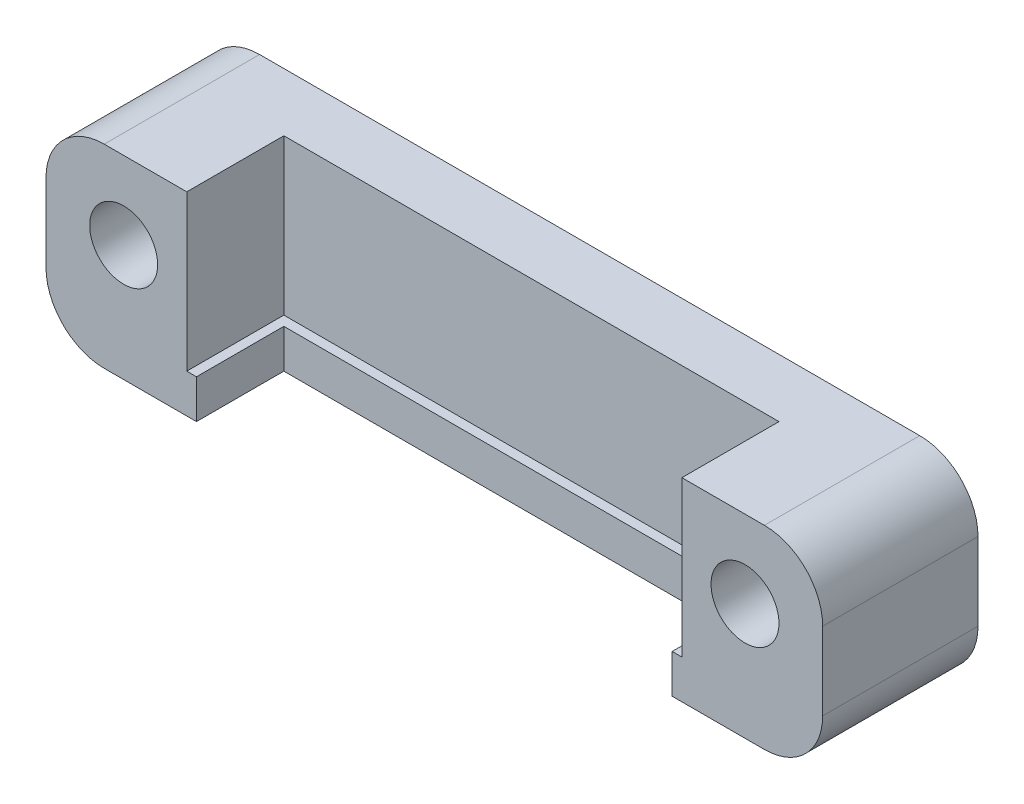
ISO-10303-21;
HEADER;
FILE_DESCRIPTION(('STEP AP214'),'2;1');
FILE_NAME('part.step','',(''),(''),'','','');
FILE_SCHEMA(('AUTOMOTIVE_DESIGN { 1 0 10303 214 1 1 1 1 }'));
ENDSEC;
DATA;
#1=APPLICATION_CONTEXT('core data for automotive mechanical design processes');
#2=APPLICATION_PROTOCOL_DEFINITION('international standard','automotive_design',2000,#1);
#3=PRODUCT_CONTEXT('',#1,'mechanical');
#4=PRODUCT('Part','Part','',(#3));
#5=PRODUCT_RELATED_PRODUCT_CATEGORY('part','',(#4));
#6=PRODUCT_DEFINITION_FORMATION('','',#4);
#7=PRODUCT_DEFINITION_CONTEXT('part definition',#1,'design');
#8=PRODUCT_DEFINITION('design','',#6,#7);
#9=PRODUCT_DEFINITION_SHAPE('','',#8);
#10=(LENGTH_UNIT() NAMED_UNIT(*) SI_UNIT(.MILLI.,.METRE.));
#11=(NAMED_UNIT(*) PLANE_ANGLE_UNIT() SI_UNIT($,.RADIAN.));
#12=(NAMED_UNIT(*) SI_UNIT($,.STERADIAN.) SOLID_ANGLE_UNIT());
#13=UNCERTAINTY_MEASURE_WITH_UNIT(LENGTH_MEASURE(1.E-05),#10,'distance_accuracy_value','');
#14=(GEOMETRIC_REPRESENTATION_CONTEXT(3) GLOBAL_UNCERTAINTY_ASSIGNED_CONTEXT((#13)) GLOBAL_UNIT_ASSIGNED_CONTEXT((#10,
#11,#12)) REPRESENTATION_CONTEXT('',''));
#15=CARTESIAN_POINT('',(0.,0.,0.));
#16=DIRECTION('',(0.,0.,1.));
#17=DIRECTION('',(1.,0.,0.));
#18=AXIS2_PLACEMENT_3D('',#15,#16,#17);
#19=CARTESIAN_POINT('',(17.,7.00000000000002,8.));
#20=DIRECTION('',(0.,0.,-1.));
#21=DIRECTION('',(-1.,0.,0.));
#22=AXIS2_PLACEMENT_3D('',#19,#20,#21);
#23=PLANE('',#22);
#24=CARTESIAN_POINT('',(-16.,6.00000000000002,8.));
#25=DIRECTION('',(0.,0.,1.));
#26=DIRECTION('',(1.,0.,0.));
#27=AXIS2_PLACEMENT_3D('',#24,#25,#26);
#28=CIRCLE('',#27,1.75);
#29=CARTESIAN_POINT('',(-14.25,6.00000000000002,8.));
#30=VERTEX_POINT('',#29);
#31=EDGE_CURVE('E189',#30,#30,#28,.T.);
#32=ORIENTED_EDGE('',*,*,#31,.F.);
#33=EDGE_LOOP('',(#32));
#34=FACE_BOUND('',#33,.T.);
#35=DIRECTION('',(1.,0.,0.));
#36=VECTOR('',#35,1.);
#37=CARTESIAN_POINT('',(-17.,0.,8.));
#38=LINE('',#37,#36);
#39=CARTESIAN_POINT('',(-17.,0.,8.));
#40=VERTEX_POINT('',#39);
#41=CARTESIAN_POINT('',(-12.25,0.,8.));
#42=VERTEX_POINT('',#41);
#43=EDGE_CURVE('E166',#40,#42,#38,.T.);
#44=ORIENTED_EDGE('',*,*,#43,.T.);
#45=DIRECTION('',(0.,1.,0.));
#46=VECTOR('',#45,1.);
#47=CARTESIAN_POINT('',(-12.25,0.,8.));
#48=LINE('',#47,#46);
#49=CARTESIAN_POINT('',(-12.25,2.00000000000002,8.));
#50=VERTEX_POINT('',#49);
#51=EDGE_CURVE('E149',#42,#50,#48,.T.);
#52=ORIENTED_EDGE('',*,*,#51,.T.);
#53=DIRECTION('',(1.,0.,0.));
#54=VECTOR('',#53,1.);
#55=CARTESIAN_POINT('',(-12.75,2.00000000000002,8.));
#56=LINE('',#55,#54);
#57=CARTESIAN_POINT('',(-12.75,2.00000000000002,8.));
#58=VERTEX_POINT('',#57);
#59=EDGE_CURVE('E276',#58,#50,#56,.T.);
#60=ORIENTED_EDGE('',*,*,#59,.F.);
#61=DIRECTION('',(0.,-1.,0.));
#62=VECTOR('',#61,1.);
#63=CARTESIAN_POINT('',(-12.75,10.,8.));
#64=LINE('',#63,#62);
#65=CARTESIAN_POINT('',(-12.75,10.,8.));
#66=VERTEX_POINT('',#65);
#67=EDGE_CURVE('E279',#66,#58,#64,.T.);
#68=ORIENTED_EDGE('',*,*,#67,.F.);
#69=DIRECTION('',(-1.,0.,0.));
#70=VECTOR('',#69,1.);
#71=CARTESIAN_POINT('',(-17.,10.,8.));
#72=LINE('',#71,#70);
#73=CARTESIAN_POINT('',(-17.,10.,8.));
#74=VERTEX_POINT('',#73);
#75=EDGE_CURVE('E248',#66,#74,#72,.T.);
#76=ORIENTED_EDGE('',*,*,#75,.T.);
#77=CARTESIAN_POINT('',(-17.,7.00000000000002,8.));
#78=DIRECTION('',(0.,0.,1.));
#79=DIRECTION('',(1.,0.,0.));
#80=AXIS2_PLACEMENT_3D('',#77,#78,#79);
#81=CIRCLE('',#80,3.);
#82=CARTESIAN_POINT('',(-20.,7.,8.));
#83=VERTEX_POINT('',#82);
#84=EDGE_CURVE('E226',#74,#83,#81,.T.);
#85=ORIENTED_EDGE('',*,*,#84,.T.);
#86=DIRECTION('',(0.,-1.,0.));
#87=VECTOR('',#86,1.);
#88=CARTESIAN_POINT('',(-20.,7.,8.));
#89=LINE('',#88,#87);
#90=CARTESIAN_POINT('',(-20.,3.00000000000002,8.));
#91=VERTEX_POINT('',#90);
#92=EDGE_CURVE('E242',#83,#91,#89,.T.);
#93=ORIENTED_EDGE('',*,*,#92,.T.);
#94=CARTESIAN_POINT('',(-17.,3.,8.));
#95=DIRECTION('',(0.,0.,1.));
#96=DIRECTION('',(1.,0.,0.));
#97=AXIS2_PLACEMENT_3D('',#94,#95,#96);
#98=CIRCLE('',#97,3.);
#99=EDGE_CURVE('E173',#91,#40,#98,.T.);
#100=ORIENTED_EDGE('',*,*,#99,.T.);
#101=EDGE_LOOP('',(#44,#52,#60,#68,#76,#85,#93,#100));
#102=FACE_BOUND('',#101,.T.);
#103=ADVANCED_FACE('F33',(#34,#102),#23,.F.);
#104=CARTESIAN_POINT('',(12.25,2.00000000000002,8.));
#105=VERTEX_POINT('',#104);
#106=CARTESIAN_POINT('',(12.75,2.00000000000002,8.));
#107=VERTEX_POINT('',#106);
#108=EDGE_CURVE('E278',#105,#107,#56,.T.);
#109=ORIENTED_EDGE('',*,*,#108,.F.);
#110=DIRECTION('',(0.,1.,0.));
#111=VECTOR('',#110,1.);
#112=CARTESIAN_POINT('',(12.25,0.,8.));
#113=LINE('',#112,#111);
#114=CARTESIAN_POINT('',(12.25,0.,8.));
#115=VERTEX_POINT('',#114);
#116=EDGE_CURVE('E48',#115,#105,#113,.T.);
#117=ORIENTED_EDGE('',*,*,#116,.F.);
#118=CARTESIAN_POINT('',(17.,0.,8.));
#119=VERTEX_POINT('',#118);
#120=EDGE_CURVE('E176',#115,#119,#38,.T.);
#121=ORIENTED_EDGE('',*,*,#120,.T.);
#122=CARTESIAN_POINT('',(17.,3.,8.));
#123=DIRECTION('',(0.,0.,1.));
#124=DIRECTION('',(1.,0.,0.));
#125=AXIS2_PLACEMENT_3D('',#122,#123,#124);
#126=CIRCLE('',#125,3.);
#127=CARTESIAN_POINT('',(20.,3.00000000000002,8.));
#128=VERTEX_POINT('',#127);
#129=EDGE_CURVE('E175',#119,#128,#126,.T.);
#130=ORIENTED_EDGE('',*,*,#129,.T.);
#131=DIRECTION('',(0.,1.,0.));
#132=VECTOR('',#131,1.);
#133=CARTESIAN_POINT('',(20.,7.,8.));
#134=LINE('',#133,#132);
#135=CARTESIAN_POINT('',(20.,7.,8.));
#136=VERTEX_POINT('',#135);
#137=EDGE_CURVE('E178',#128,#136,#134,.T.);
#138=ORIENTED_EDGE('',*,*,#137,.T.);
#139=CARTESIAN_POINT('',(17.,7.00000000000002,8.));
#140=DIRECTION('',(0.,0.,1.));
#141=DIRECTION('',(-1.,0.,0.));
#142=AXIS2_PLACEMENT_3D('',#139,#140,#141);
#143=CIRCLE('',#142,3.);
#144=CARTESIAN_POINT('',(17.,10.,8.));
#145=VERTEX_POINT('',#144);
#146=EDGE_CURVE('E203',#136,#145,#143,.T.);
#147=ORIENTED_EDGE('',*,*,#146,.T.);
#148=CARTESIAN_POINT('',(12.75,10.,8.));
#149=VERTEX_POINT('',#148);
#150=EDGE_CURVE('E243',#145,#149,#72,.T.);
#151=ORIENTED_EDGE('',*,*,#150,.T.);
#152=DIRECTION('',(0.,1.,0.));
#153=VECTOR('',#152,1.);
#154=CARTESIAN_POINT('',(12.75,10.,8.));
#155=LINE('',#154,#153);
#156=EDGE_CURVE('E273',#107,#149,#155,.T.);
#157=ORIENTED_EDGE('',*,*,#156,.F.);
#158=EDGE_LOOP('',(#109,#117,#121,#130,#138,#147,#151,#157));
#159=FACE_BOUND('',#158,.T.);
#160=CARTESIAN_POINT('',(16.,6.00000000000002,8.));
#161=DIRECTION('',(0.,0.,1.));
#162=DIRECTION('',(1.,0.,0.));
#163=AXIS2_PLACEMENT_3D('',#160,#161,#162);
#164=CIRCLE('',#163,1.75);
#165=CARTESIAN_POINT('',(17.75,6.00000000000002,8.));
#166=VERTEX_POINT('',#165);
#167=EDGE_CURVE('E254',#166,#166,#164,.T.);
#168=ORIENTED_EDGE('',*,*,#167,.F.);
#169=EDGE_LOOP('',(#168));
#170=FACE_BOUND('',#169,.T.);
#171=ADVANCED_FACE('F304',(#159,#170),#23,.F.);
#172=CARTESIAN_POINT('',(17.,7.00000000000002,0.));
#173=DIRECTION('',(0.,0.,-1.));
#174=DIRECTION('',(-1.,0.,0.));
#175=AXIS2_PLACEMENT_3D('',#172,#173,#174);
#176=PLANE('',#175);
#177=CARTESIAN_POINT('',(-16.,6.00000000000002,0.));
#178=DIRECTION('',(0.,0.,1.));
#179=DIRECTION('',(1.,0.,0.));
#180=AXIS2_PLACEMENT_3D('',#177,#178,#179);
#181=CIRCLE('',#180,1.75);
#182=CARTESIAN_POINT('',(-14.25,6.00000000000002,0.));
#183=VERTEX_POINT('',#182);
#184=EDGE_CURVE('E251',#183,#183,#181,.T.);
#185=ORIENTED_EDGE('',*,*,#184,.T.);
#186=EDGE_LOOP('',(#185));
#187=FACE_BOUND('',#186,.T.);
#188=CARTESIAN_POINT('',(17.,7.00000000000002,0.));
#189=DIRECTION('',(0.,0.,1.));
#190=DIRECTION('',(-1.,0.,0.));
#191=AXIS2_PLACEMENT_3D('',#188,#189,#190);
#192=CIRCLE('',#191,3.);
#193=CARTESIAN_POINT('',(20.,7.,0.));
#194=VERTEX_POINT('',#193);
#195=CARTESIAN_POINT('',(17.,10.,0.));
#196=VERTEX_POINT('',#195);
#197=EDGE_CURVE('E185',#194,#196,#192,.T.);
#198=ORIENTED_EDGE('',*,*,#197,.F.);
#199=DIRECTION('',(0.,1.,0.));
#200=VECTOR('',#199,1.);
#201=CARTESIAN_POINT('',(20.,7.,0.));
#202=LINE('',#201,#200);
#203=CARTESIAN_POINT('',(20.,3.00000000000002,0.));
#204=VERTEX_POINT('',#203);
#205=EDGE_CURVE('E201',#204,#194,#202,.T.);
#206=ORIENTED_EDGE('',*,*,#205,.F.);
#207=CARTESIAN_POINT('',(17.,3.,0.));
#208=DIRECTION('',(0.,0.,1.));
#209=DIRECTION('',(1.,0.,0.));
#210=AXIS2_PLACEMENT_3D('',#207,#208,#209);
#211=CIRCLE('',#210,3.);
#212=CARTESIAN_POINT('',(17.,0.,0.));
#213=VERTEX_POINT('',#212);
#214=EDGE_CURVE('E199',#213,#204,#211,.T.);
#215=ORIENTED_EDGE('',*,*,#214,.F.);
#216=DIRECTION('',(1.,0.,0.));
#217=VECTOR('',#216,1.);
#218=CARTESIAN_POINT('',(-17.,0.,0.));
#219=LINE('',#218,#217);
#220=CARTESIAN_POINT('',(-17.,0.,0.));
#221=VERTEX_POINT('',#220);
#222=EDGE_CURVE('E197',#221,#213,#219,.T.);
#223=ORIENTED_EDGE('',*,*,#222,.F.);
#224=CARTESIAN_POINT('',(-17.,3.,0.));
#225=DIRECTION('',(0.,0.,1.));
#226=DIRECTION('',(1.,0.,0.));
#227=AXIS2_PLACEMENT_3D('',#224,#225,#226);
#228=CIRCLE('',#227,3.);
#229=CARTESIAN_POINT('',(-20.,3.00000000000002,0.));
#230=VERTEX_POINT('',#229);
#231=EDGE_CURVE('E195',#230,#221,#228,.T.);
#232=ORIENTED_EDGE('',*,*,#231,.F.);
#233=DIRECTION('',(0.,-1.,0.));
#234=VECTOR('',#233,1.);
#235=CARTESIAN_POINT('',(-20.,7.,0.));
#236=LINE('',#235,#234);
#237=CARTESIAN_POINT('',(-20.,7.,0.));
#238=VERTEX_POINT('',#237);
#239=EDGE_CURVE('E193',#238,#230,#236,.T.);
#240=ORIENTED_EDGE('',*,*,#239,.F.);
#241=CARTESIAN_POINT('',(-17.,7.00000000000002,0.));
#242=DIRECTION('',(0.,0.,1.));
#243=DIRECTION('',(1.,0.,0.));
#244=AXIS2_PLACEMENT_3D('',#241,#242,#243);
#245=CIRCLE('',#244,3.);
#246=CARTESIAN_POINT('',(-17.,10.,0.));
#247=VERTEX_POINT('',#246);
#248=EDGE_CURVE('E191',#247,#238,#245,.T.);
#249=ORIENTED_EDGE('',*,*,#248,.F.);
#250=DIRECTION('',(-1.,0.,0.));
#251=VECTOR('',#250,1.);
#252=CARTESIAN_POINT('',(-17.,10.,0.));
#253=LINE('',#252,#251);
#254=EDGE_CURVE('E188',#196,#247,#253,.T.);
#255=ORIENTED_EDGE('',*,*,#254,.F.);
#256=EDGE_LOOP('',(#198,#206,#215,#223,#232,#240,#249,#255));
#257=FACE_BOUND('',#256,.T.);
#258=CARTESIAN_POINT('',(16.,6.00000000000002,0.));
#259=DIRECTION('',(0.,0.,1.));
#260=DIRECTION('',(1.,0.,0.));
#261=AXIS2_PLACEMENT_3D('',#258,#259,#260);
#262=CIRCLE('',#261,1.75);
#263=CARTESIAN_POINT('',(17.75,6.00000000000002,0.));
#264=VERTEX_POINT('',#263);
#265=EDGE_CURVE('E257',#264,#264,#262,.T.);
#266=ORIENTED_EDGE('',*,*,#265,.T.);
#267=EDGE_LOOP('',(#266));
#268=FACE_BOUND('',#267,.T.);
#269=ADVANCED_FACE('F232',(#187,#257,#268),#176,.T.);
#270=CARTESIAN_POINT('',(17.,7.00000000000002,8.));
#271=DIRECTION('',(0.,0.,-1.));
#272=DIRECTION('',(-1.,0.,0.));
#273=AXIS2_PLACEMENT_3D('',#270,#271,#272);
#274=CYLINDRICAL_SURFACE('',#273,3.);
#275=ORIENTED_EDGE('',*,*,#197,.T.);
#276=DIRECTION('',(0.,0.,-1.));
#277=VECTOR('',#276,1.);
#278=CARTESIAN_POINT('',(17.,10.,8.));
#279=LINE('',#278,#277);
#280=EDGE_CURVE('E11',#145,#196,#279,.T.);
#281=ORIENTED_EDGE('',*,*,#280,.F.);
#282=ORIENTED_EDGE('',*,*,#146,.F.);
#283=DIRECTION('',(0.,0.,-1.));
#284=VECTOR('',#283,1.);
#285=CARTESIAN_POINT('',(20.,7.,8.));
#286=LINE('',#285,#284);
#287=EDGE_CURVE('E184',#136,#194,#286,.T.);
#288=ORIENTED_EDGE('',*,*,#287,.T.);
#289=EDGE_LOOP('',(#275,#281,#282,#288));
#290=FACE_BOUND('',#289,.T.);
#291=ADVANCED_FACE('F35',(#290),#274,.T.);
#292=CARTESIAN_POINT('',(-17.,10.,8.));
#293=DIRECTION('',(0.,-1.,0.));
#294=DIRECTION('',(0.,0.,-1.));
#295=AXIS2_PLACEMENT_3D('',#292,#293,#294);
#296=PLANE('',#295);
#297=ORIENTED_EDGE('',*,*,#75,.F.);
#298=DIRECTION('',(0.,0.,1.));
#299=VECTOR('',#298,1.);
#300=CARTESIAN_POINT('',(-12.75,10.,3.));
#301=LINE('',#300,#299);
#302=CARTESIAN_POINT('',(-12.75,10.,3.));
#303=VERTEX_POINT('',#302);
#304=EDGE_CURVE('E260',#303,#66,#301,.T.);
#305=ORIENTED_EDGE('',*,*,#304,.F.);
#306=DIRECTION('',(-1.,0.,0.));
#307=VECTOR('',#306,1.);
#308=CARTESIAN_POINT('',(-12.75,10.,3.));
#309=LINE('',#308,#307);
#310=CARTESIAN_POINT('',(12.75,10.,3.));
#311=VERTEX_POINT('',#310);
#312=EDGE_CURVE('E266',#311,#303,#309,.T.);
#313=ORIENTED_EDGE('',*,*,#312,.F.);
#314=DIRECTION('',(0.,0.,1.));
#315=VECTOR('',#314,1.);
#316=CARTESIAN_POINT('',(12.75,10.,3.));
#317=LINE('',#316,#315);
#318=EDGE_CURVE('E269',#311,#149,#317,.T.);
#319=ORIENTED_EDGE('',*,*,#318,.T.);
#320=ORIENTED_EDGE('',*,*,#150,.F.);
#321=ORIENTED_EDGE('',*,*,#280,.T.);
#322=ORIENTED_EDGE('',*,*,#254,.T.);
#323=DIRECTION('',(0.,0.,-1.));
#324=VECTOR('',#323,1.);
#325=CARTESIAN_POINT('',(-17.,10.,8.));
#326=LINE('',#325,#324);
#327=EDGE_CURVE('E41',#74,#247,#326,.T.);
#328=ORIENTED_EDGE('',*,*,#327,.F.);
#329=EDGE_LOOP('',(#297,#305,#313,#319,#320,#321,#322,#328));
#330=FACE_BOUND('',#329,.T.);
#331=ADVANCED_FACE('F319',(#330),#296,.F.);
#332=CARTESIAN_POINT('',(-17.,7.00000000000002,8.));
#333=DIRECTION('',(0.,0.,-1.));
#334=DIRECTION('',(-1.,0.,0.));
#335=AXIS2_PLACEMENT_3D('',#332,#333,#334);
#336=CYLINDRICAL_SURFACE('',#335,3.);
#337=ORIENTED_EDGE('',*,*,#248,.T.);
#338=DIRECTION('',(0.,0.,-1.));
#339=VECTOR('',#338,1.);
#340=CARTESIAN_POINT('',(-20.,7.,8.));
#341=LINE('',#340,#339);
#342=EDGE_CURVE('E217',#83,#238,#341,.T.);
#343=ORIENTED_EDGE('',*,*,#342,.F.);
#344=ORIENTED_EDGE('',*,*,#84,.F.);
#345=ORIENTED_EDGE('',*,*,#327,.T.);
#346=EDGE_LOOP('',(#337,#343,#344,#345));
#347=FACE_BOUND('',#346,.T.);
#348=ADVANCED_FACE('F224',(#347),#336,.T.);
#349=CARTESIAN_POINT('',(-20.,7.,8.));
#350=DIRECTION('',(1.,0.,0.));
#351=DIRECTION('',(0.,0.,-1.));
#352=AXIS2_PLACEMENT_3D('',#349,#350,#351);
#353=PLANE('',#352);
#354=ORIENTED_EDGE('',*,*,#239,.T.);
#355=DIRECTION('',(0.,0.,-1.));
#356=VECTOR('',#355,1.);
#357=CARTESIAN_POINT('',(-20.,3.00000000000002,8.));
#358=LINE('',#357,#356);
#359=EDGE_CURVE('E214',#91,#230,#358,.T.);
#360=ORIENTED_EDGE('',*,*,#359,.F.);
#361=ORIENTED_EDGE('',*,*,#92,.F.);
#362=ORIENTED_EDGE('',*,*,#342,.T.);
#363=EDGE_LOOP('',(#354,#360,#361,#362));
#364=FACE_BOUND('',#363,.T.);
#365=ADVANCED_FACE('F238',(#364),#353,.F.);
#366=CARTESIAN_POINT('',(-17.,3.,8.));
#367=DIRECTION('',(0.,0.,-1.));
#368=DIRECTION('',(-1.,0.,0.));
#369=AXIS2_PLACEMENT_3D('',#366,#367,#368);
#370=CYLINDRICAL_SURFACE('',#369,3.);
#371=ORIENTED_EDGE('',*,*,#231,.T.);
#372=DIRECTION('',(0.,0.,-1.));
#373=VECTOR('',#372,1.);
#374=CARTESIAN_POINT('',(-17.,0.,8.));
#375=LINE('',#374,#373);
#376=EDGE_CURVE('E212',#40,#221,#375,.T.);
#377=ORIENTED_EDGE('',*,*,#376,.F.);
#378=ORIENTED_EDGE('',*,*,#99,.F.);
#379=ORIENTED_EDGE('',*,*,#359,.T.);
#380=EDGE_LOOP('',(#371,#377,#378,#379));
#381=FACE_BOUND('',#380,.T.);
#382=ADVANCED_FACE('F241',(#381),#370,.T.);
#383=CARTESIAN_POINT('',(-17.,0.,8.));
#384=DIRECTION('',(0.,1.,0.));
#385=DIRECTION('',(0.,0.,1.));
#386=AXIS2_PLACEMENT_3D('',#383,#384,#385);
#387=PLANE('',#386);
#388=DIRECTION('',(-1.,0.,0.));
#389=VECTOR('',#388,1.);
#390=CARTESIAN_POINT('',(-12.25,0.,3.5));
#391=LINE('',#390,#389);
#392=CARTESIAN_POINT('',(12.25,0.,3.5));
#393=VERTEX_POINT('',#392);
#394=CARTESIAN_POINT('',(-12.25,0.,3.5));
#395=VERTEX_POINT('',#394);
#396=EDGE_CURVE('E160',#393,#395,#391,.T.);
#397=ORIENTED_EDGE('',*,*,#396,.T.);
#398=DIRECTION('',(0.,0.,1.));
#399=VECTOR('',#398,1.);
#400=CARTESIAN_POINT('',(-12.25,0.,8.));
#401=LINE('',#400,#399);
#402=EDGE_CURVE('E152',#395,#42,#401,.T.);
#403=ORIENTED_EDGE('',*,*,#402,.T.);
#404=ORIENTED_EDGE('',*,*,#43,.F.);
#405=ORIENTED_EDGE('',*,*,#376,.T.);
#406=ORIENTED_EDGE('',*,*,#222,.T.);
#407=DIRECTION('',(0.,0.,-1.));
#408=VECTOR('',#407,1.);
#409=CARTESIAN_POINT('',(17.,0.,8.));
#410=LINE('',#409,#408);
#411=EDGE_CURVE('E209',#119,#213,#410,.T.);
#412=ORIENTED_EDGE('',*,*,#411,.F.);
#413=ORIENTED_EDGE('',*,*,#120,.F.);
#414=DIRECTION('',(0.,0.,-1.));
#415=VECTOR('',#414,1.);
#416=CARTESIAN_POINT('',(12.25,0.,8.));
#417=LINE('',#416,#415);
#418=EDGE_CURVE('E169',#115,#393,#417,.T.);
#419=ORIENTED_EDGE('',*,*,#418,.T.);
#420=EDGE_LOOP('',(#397,#403,#404,#405,#406,#412,#413,#419));
#421=FACE_BOUND('',#420,.T.);
#422=ADVANCED_FACE('F164',(#421),#387,.F.);
#423=CARTESIAN_POINT('',(17.,3.,8.));
#424=DIRECTION('',(0.,0.,-1.));
#425=DIRECTION('',(-1.,0.,0.));
#426=AXIS2_PLACEMENT_3D('',#423,#424,#425);
#427=CYLINDRICAL_SURFACE('',#426,3.);
#428=ORIENTED_EDGE('',*,*,#214,.T.);
#429=DIRECTION('',(0.,0.,-1.));
#430=VECTOR('',#429,1.);
#431=CARTESIAN_POINT('',(20.,3.00000000000002,8.));
#432=LINE('',#431,#430);
#433=EDGE_CURVE('E206',#128,#204,#432,.T.);
#434=ORIENTED_EDGE('',*,*,#433,.F.);
#435=ORIENTED_EDGE('',*,*,#129,.F.);
#436=ORIENTED_EDGE('',*,*,#411,.T.);
#437=EDGE_LOOP('',(#428,#434,#435,#436));
#438=FACE_BOUND('',#437,.T.);
#439=ADVANCED_FACE('F332',(#438),#427,.T.);
#440=CARTESIAN_POINT('',(20.,7.,8.));
#441=DIRECTION('',(-1.,0.,0.));
#442=DIRECTION('',(0.,0.,1.));
#443=AXIS2_PLACEMENT_3D('',#440,#441,#442);
#444=PLANE('',#443);
#445=ORIENTED_EDGE('',*,*,#205,.T.);
#446=ORIENTED_EDGE('',*,*,#287,.F.);
#447=ORIENTED_EDGE('',*,*,#137,.F.);
#448=ORIENTED_EDGE('',*,*,#433,.T.);
#449=EDGE_LOOP('',(#445,#446,#447,#448));
#450=FACE_BOUND('',#449,.T.);
#451=ADVANCED_FACE('F328',(#450),#444,.F.);
#452=CARTESIAN_POINT('',(-16.,6.00000000000002,8.));
#453=DIRECTION('',(0.,0.,-1.));
#454=DIRECTION('',(-1.,0.,0.));
#455=AXIS2_PLACEMENT_3D('',#452,#453,#454);
#456=CYLINDRICAL_SURFACE('',#455,1.75);
#457=ORIENTED_EDGE('',*,*,#31,.T.);
#458=EDGE_LOOP('',(#457));
#459=FACE_BOUND('',#458,.T.);
#460=ORIENTED_EDGE('',*,*,#184,.F.);
#461=EDGE_LOOP('',(#460));
#462=FACE_BOUND('',#461,.T.);
#463=ADVANCED_FACE('F339',(#459,#462),#456,.F.);
#464=CARTESIAN_POINT('',(16.,6.00000000000002,8.));
#465=DIRECTION('',(0.,0.,-1.));
#466=DIRECTION('',(-1.,0.,0.));
#467=AXIS2_PLACEMENT_3D('',#464,#465,#466);
#468=CYLINDRICAL_SURFACE('',#467,1.75);
#469=ORIENTED_EDGE('',*,*,#167,.T.);
#470=EDGE_LOOP('',(#469));
#471=FACE_BOUND('',#470,.T.);
#472=ORIENTED_EDGE('',*,*,#265,.F.);
#473=EDGE_LOOP('',(#472));
#474=FACE_BOUND('',#473,.T.);
#475=ADVANCED_FACE('F360',(#471,#474),#468,.F.);
#476=CARTESIAN_POINT('',(-12.75,10.,3.));
#477=DIRECTION('',(-1.,0.,0.));
#478=DIRECTION('',(0.,-1.,0.));
#479=AXIS2_PLACEMENT_3D('',#476,#477,#478);
#480=PLANE('',#479);
#481=ORIENTED_EDGE('',*,*,#67,.T.);
#482=DIRECTION('',(0.,0.,1.));
#483=VECTOR('',#482,1.);
#484=CARTESIAN_POINT('',(-12.75,2.00000000000002,3.));
#485=LINE('',#484,#483);
#486=CARTESIAN_POINT('',(-12.75,2.00000000000002,3.));
#487=VERTEX_POINT('',#486);
#488=EDGE_CURVE('E263',#487,#58,#485,.T.);
#489=ORIENTED_EDGE('',*,*,#488,.F.);
#490=DIRECTION('',(0.,-1.,0.));
#491=VECTOR('',#490,1.);
#492=CARTESIAN_POINT('',(-12.75,10.,3.));
#493=LINE('',#492,#491);
#494=EDGE_CURVE('E275',#303,#487,#493,.T.);
#495=ORIENTED_EDGE('',*,*,#494,.F.);
#496=ORIENTED_EDGE('',*,*,#304,.T.);
#497=EDGE_LOOP('',(#481,#489,#495,#496));
#498=FACE_BOUND('',#497,.T.);
#499=ADVANCED_FACE('F317',(#498),#480,.F.);
#500=CARTESIAN_POINT('',(12.75,10.,3.));
#501=DIRECTION('',(1.,0.,0.));
#502=DIRECTION('',(0.,0.,-1.));
#503=AXIS2_PLACEMENT_3D('',#500,#501,#502);
#504=PLANE('',#503);
#505=ORIENTED_EDGE('',*,*,#156,.T.);
#506=ORIENTED_EDGE('',*,*,#318,.F.);
#507=DIRECTION('',(0.,1.,0.));
#508=VECTOR('',#507,1.);
#509=CARTESIAN_POINT('',(12.75,10.,3.));
#510=LINE('',#509,#508);
#511=CARTESIAN_POINT('',(12.75,2.00000000000002,3.));
#512=VERTEX_POINT('',#511);
#513=EDGE_CURVE('E56',#512,#311,#510,.T.);
#514=ORIENTED_EDGE('',*,*,#513,.F.);
#515=DIRECTION('',(0.,0.,1.));
#516=VECTOR('',#515,1.);
#517=CARTESIAN_POINT('',(12.75,2.00000000000002,3.));
#518=LINE('',#517,#516);
#519=EDGE_CURVE('E265',#512,#107,#518,.T.);
#520=ORIENTED_EDGE('',*,*,#519,.T.);
#521=EDGE_LOOP('',(#505,#506,#514,#520));
#522=FACE_BOUND('',#521,.T.);
#523=ADVANCED_FACE('F312',(#522),#504,.F.);
#524=CARTESIAN_POINT('',(-12.75,2.00000000000002,3.));
#525=DIRECTION('',(0.,-1.,0.));
#526=DIRECTION('',(1.,0.,0.));
#527=AXIS2_PLACEMENT_3D('',#524,#525,#526);
#528=PLANE('',#527);
#529=ORIENTED_EDGE('',*,*,#59,.T.);
#530=DIRECTION('',(0.,0.,1.));
#531=VECTOR('',#530,1.);
#532=CARTESIAN_POINT('',(-12.25,2.00000000000002,8.));
#533=LINE('',#532,#531);
#534=CARTESIAN_POINT('',(-12.25,2.00000000000002,3.5));
#535=VERTEX_POINT('',#534);
#536=EDGE_CURVE('E155',#535,#50,#533,.T.);
#537=ORIENTED_EDGE('',*,*,#536,.F.);
#538=DIRECTION('',(-1.,0.,0.));
#539=VECTOR('',#538,1.);
#540=CARTESIAN_POINT('',(-12.25,2.00000000000002,3.5));
#541=LINE('',#540,#539);
#542=CARTESIAN_POINT('',(12.25,2.00000000000002,3.5));
#543=VERTEX_POINT('',#542);
#544=EDGE_CURVE('E170',#543,#535,#541,.T.);
#545=ORIENTED_EDGE('',*,*,#544,.F.);
#546=DIRECTION('',(0.,0.,-1.));
#547=VECTOR('',#546,1.);
#548=CARTESIAN_POINT('',(12.25,2.00000000000002,8.));
#549=LINE('',#548,#547);
#550=EDGE_CURVE('E295',#105,#543,#549,.T.);
#551=ORIENTED_EDGE('',*,*,#550,.F.);
#552=ORIENTED_EDGE('',*,*,#108,.T.);
#553=ORIENTED_EDGE('',*,*,#519,.F.);
#554=DIRECTION('',(1.,0.,0.));
#555=VECTOR('',#554,1.);
#556=CARTESIAN_POINT('',(-12.75,2.00000000000002,3.));
#557=LINE('',#556,#555);
#558=EDGE_CURVE('E285',#487,#512,#557,.T.);
#559=ORIENTED_EDGE('',*,*,#558,.F.);
#560=ORIENTED_EDGE('',*,*,#488,.T.);
#561=EDGE_LOOP('',(#529,#537,#545,#551,#552,#553,#559,#560));
#562=FACE_BOUND('',#561,.T.);
#563=ADVANCED_FACE('F308',(#562),#528,.F.);
#564=CARTESIAN_POINT('',(-12.75,2.00000000000002,3.));
#565=DIRECTION('',(0.,0.,1.));
#566=DIRECTION('',(1.,0.,0.));
#567=AXIS2_PLACEMENT_3D('',#564,#565,#566);
#568=PLANE('',#567);
#569=ORIENTED_EDGE('',*,*,#494,.T.);
#570=ORIENTED_EDGE('',*,*,#558,.T.);
#571=ORIENTED_EDGE('',*,*,#513,.T.);
#572=ORIENTED_EDGE('',*,*,#312,.T.);
#573=EDGE_LOOP('',(#569,#570,#571,#572));
#574=FACE_BOUND('',#573,.T.);
#575=ADVANCED_FACE('F314',(#574),#568,.T.);
#576=CARTESIAN_POINT('',(-12.25,0.,8.));
#577=DIRECTION('',(-1.,0.,0.));
#578=DIRECTION('',(0.,-1.,0.));
#579=AXIS2_PLACEMENT_3D('',#576,#577,#578);
#580=PLANE('',#579);
#581=ORIENTED_EDGE('',*,*,#536,.T.);
#582=ORIENTED_EDGE('',*,*,#51,.F.);
#583=ORIENTED_EDGE('',*,*,#402,.F.);
#584=DIRECTION('',(0.,1.,0.));
#585=VECTOR('',#584,1.);
#586=CARTESIAN_POINT('',(-12.25,0.,3.5));
#587=LINE('',#586,#585);
#588=EDGE_CURVE('E282',#395,#535,#587,.T.);
#589=ORIENTED_EDGE('',*,*,#588,.T.);
#590=EDGE_LOOP('',(#581,#582,#583,#589));
#591=FACE_BOUND('',#590,.T.);
#592=ADVANCED_FACE('F151',(#591),#580,.F.);
#593=CARTESIAN_POINT('',(-12.25,0.,3.5));
#594=DIRECTION('',(0.,0.,-1.));
#595=DIRECTION('',(-1.,0.,0.));
#596=AXIS2_PLACEMENT_3D('',#593,#594,#595);
#597=PLANE('',#596);
#598=ORIENTED_EDGE('',*,*,#544,.T.);
#599=ORIENTED_EDGE('',*,*,#588,.F.);
#600=ORIENTED_EDGE('',*,*,#396,.F.);
#601=DIRECTION('',(0.,1.,0.));
#602=VECTOR('',#601,1.);
#603=CARTESIAN_POINT('',(12.25,0.,3.5));
#604=LINE('',#603,#602);
#605=EDGE_CURVE('E290',#393,#543,#604,.T.);
#606=ORIENTED_EDGE('',*,*,#605,.T.);
#607=EDGE_LOOP('',(#598,#599,#600,#606));
#608=FACE_BOUND('',#607,.T.);
#609=ADVANCED_FACE('F380',(#608),#597,.F.);
#610=CARTESIAN_POINT('',(12.25,0.,8.));
#611=DIRECTION('',(1.,0.,0.));
#612=DIRECTION('',(0.,1.,0.));
#613=AXIS2_PLACEMENT_3D('',#610,#611,#612);
#614=PLANE('',#613);
#615=ORIENTED_EDGE('',*,*,#550,.T.);
#616=ORIENTED_EDGE('',*,*,#605,.F.);
#617=ORIENTED_EDGE('',*,*,#418,.F.);
#618=ORIENTED_EDGE('',*,*,#116,.T.);
#619=EDGE_LOOP('',(#615,#616,#617,#618));
#620=FACE_BOUND('',#619,.T.);
#621=ADVANCED_FACE('F301',(#620),#614,.F.);
#622=CLOSED_SHELL('',(#103,#171,#269,#291,#331,#348,#365,#382,#422,#439,#451,#463,#475,#499,
#523,#563,#575,#592,#609,#621));
#623=MANIFOLD_SOLID_BREP('B2',#622);
#624=ADVANCED_BREP_SHAPE_REPRESENTATION('',(#18,#623),#14);
#625=SHAPE_DEFINITION_REPRESENTATION(#9,#624);
ENDSEC;
END-ISO-10303-21;
